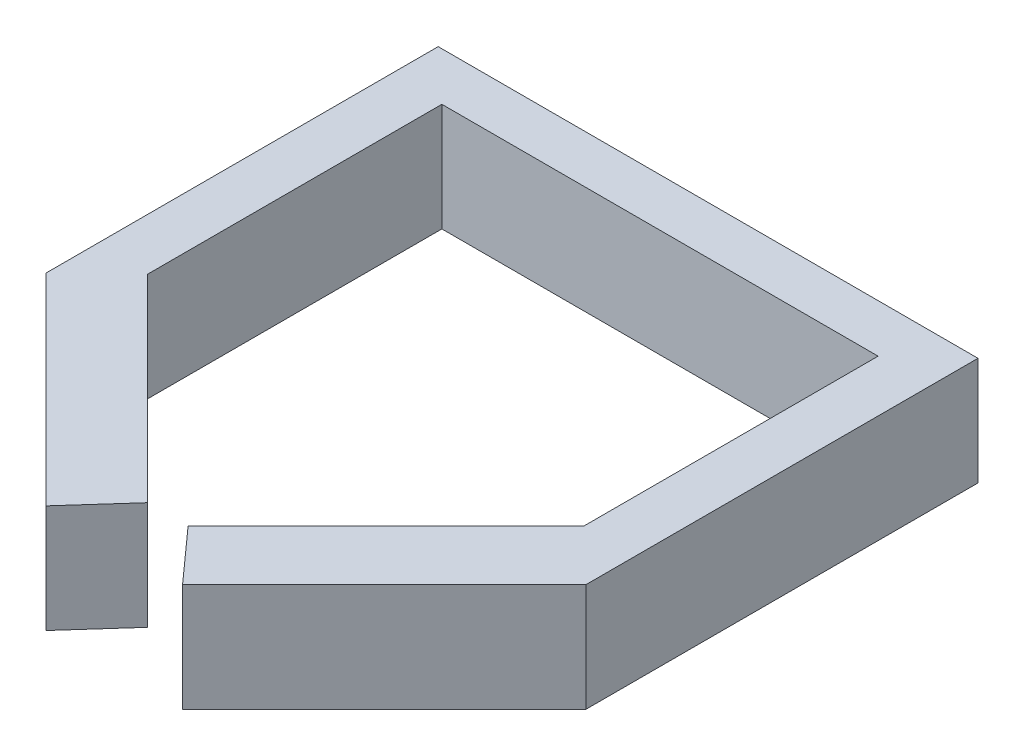
ISO-10303-21;
HEADER;
FILE_DESCRIPTION(('STEP AP214'),'2;1');
FILE_NAME('part.step','',(''),(''),'','','');
FILE_SCHEMA(('AUTOMOTIVE_DESIGN { 1 0 10303 214 1 1 1 1 }'));
ENDSEC;
DATA;
#1=APPLICATION_CONTEXT('core data for automotive mechanical design processes');
#2=APPLICATION_PROTOCOL_DEFINITION('international standard','automotive_design',2000,#1);
#3=PRODUCT_CONTEXT('',#1,'mechanical');
#4=PRODUCT('Part','Part','',(#3));
#5=PRODUCT_RELATED_PRODUCT_CATEGORY('part','',(#4));
#6=PRODUCT_DEFINITION_FORMATION('','',#4);
#7=PRODUCT_DEFINITION_CONTEXT('part definition',#1,'design');
#8=PRODUCT_DEFINITION('design','',#6,#7);
#9=PRODUCT_DEFINITION_SHAPE('','',#8);
#10=(LENGTH_UNIT() NAMED_UNIT(*) SI_UNIT(.MILLI.,.METRE.));
#11=(NAMED_UNIT(*) PLANE_ANGLE_UNIT() SI_UNIT($,.RADIAN.));
#12=(NAMED_UNIT(*) SI_UNIT($,.STERADIAN.) SOLID_ANGLE_UNIT());
#13=UNCERTAINTY_MEASURE_WITH_UNIT(LENGTH_MEASURE(1.E-05),#10,'distance_accuracy_value','');
#14=(GEOMETRIC_REPRESENTATION_CONTEXT(3) GLOBAL_UNCERTAINTY_ASSIGNED_CONTEXT((#13)) GLOBAL_UNIT_ASSIGNED_CONTEXT((#10,
#11,#12)) REPRESENTATION_CONTEXT('',''));
#15=CARTESIAN_POINT('',(0.,0.,0.));
#16=DIRECTION('',(0.,0.,1.));
#17=DIRECTION('',(1.,0.,0.));
#18=AXIS2_PLACEMENT_3D('',#15,#16,#17);
#19=CARTESIAN_POINT('',(50.,10.,-18.6760124610592));
#20=DIRECTION('',(-1.,0.,0.));
#21=DIRECTION('',(0.,0.,1.));
#22=AXIS2_PLACEMENT_3D('',#19,#20,#21);
#23=PLANE('',#22);
#24=DIRECTION('',(0.,0.,-1.));
#25=VECTOR('',#24,1.);
#26=CARTESIAN_POINT('',(50.,0.,-18.6760124610592));
#27=LINE('',#26,#25);
#28=CARTESIAN_POINT('',(50.,0.,-18.6760124610592));
#29=VERTEX_POINT('',#28);
#30=CARTESIAN_POINT('',(50.,0.,-55.));
#31=VERTEX_POINT('',#30);
#32=EDGE_CURVE('E156',#29,#31,#27,.T.);
#33=ORIENTED_EDGE('',*,*,#32,.T.);
#34=DIRECTION('',(0.,-1.,0.));
#35=VECTOR('',#34,1.);
#36=CARTESIAN_POINT('',(50.,10.,-55.));
#37=LINE('',#36,#35);
#38=CARTESIAN_POINT('',(50.,10.,-55.));
#39=VERTEX_POINT('',#38);
#40=EDGE_CURVE('E11',#39,#31,#37,.T.);
#41=ORIENTED_EDGE('',*,*,#40,.F.);
#42=DIRECTION('',(0.,0.,-1.));
#43=VECTOR('',#42,1.);
#44=CARTESIAN_POINT('',(50.,10.,-18.6760124610592));
#45=LINE('',#44,#43);
#46=CARTESIAN_POINT('',(50.,10.,-18.6760124610592));
#47=VERTEX_POINT('',#46);
#48=EDGE_CURVE('E178',#47,#39,#45,.T.);
#49=ORIENTED_EDGE('',*,*,#48,.F.);
#50=DIRECTION('',(0.,-1.,0.));
#51=VECTOR('',#50,1.);
#52=CARTESIAN_POINT('',(50.,10.,-18.6760124610592));
#53=LINE('',#52,#51);
#54=EDGE_CURVE('E152',#47,#29,#53,.T.);
#55=ORIENTED_EDGE('',*,*,#54,.T.);
#56=EDGE_LOOP('',(#33,#41,#49,#55));
#57=FACE_BOUND('',#56,.T.);
#58=ADVANCED_FACE('F36',(#57),#23,.F.);
#59=CARTESIAN_POINT('',(0.,10.,-55.));
#60=DIRECTION('',(0.,0.,1.));
#61=DIRECTION('',(1.,0.,0.));
#62=AXIS2_PLACEMENT_3D('',#59,#60,#61);
#63=PLANE('',#62);
#64=DIRECTION('',(-1.,0.,0.));
#65=VECTOR('',#64,1.);
#66=CARTESIAN_POINT('',(0.,0.,-55.));
#67=LINE('',#66,#65);
#68=CARTESIAN_POINT('',(0.,0.,-55.));
#69=VERTEX_POINT('',#68);
#70=EDGE_CURVE('E159',#31,#69,#67,.T.);
#71=ORIENTED_EDGE('',*,*,#70,.T.);
#72=DIRECTION('',(0.,-1.,0.));
#73=VECTOR('',#72,1.);
#74=CARTESIAN_POINT('',(0.,10.,-55.));
#75=LINE('',#74,#73);
#76=CARTESIAN_POINT('',(0.,10.,-55.));
#77=VERTEX_POINT('',#76);
#78=EDGE_CURVE('E44',#77,#69,#75,.T.);
#79=ORIENTED_EDGE('',*,*,#78,.F.);
#80=DIRECTION('',(-1.,0.,0.));
#81=VECTOR('',#80,1.);
#82=CARTESIAN_POINT('',(0.,10.,-55.));
#83=LINE('',#82,#81);
#84=EDGE_CURVE('E107',#39,#77,#83,.T.);
#85=ORIENTED_EDGE('',*,*,#84,.F.);
#86=ORIENTED_EDGE('',*,*,#40,.T.);
#87=EDGE_LOOP('',(#71,#79,#85,#86));
#88=FACE_BOUND('',#87,.T.);
#89=ADVANCED_FACE('F256',(#88),#63,.F.);
#90=CARTESIAN_POINT('',(0.,10.,-18.6760124610592));
#91=DIRECTION('',(1.,0.,0.));
#92=DIRECTION('',(0.,0.,-1.));
#93=AXIS2_PLACEMENT_3D('',#90,#91,#92);
#94=PLANE('',#93);
#95=DIRECTION('',(0.,0.,1.));
#96=VECTOR('',#95,1.);
#97=CARTESIAN_POINT('',(0.,0.,-18.6760124610592));
#98=LINE('',#97,#96);
#99=CARTESIAN_POINT('',(0.,0.,-18.6760124610592));
#100=VERTEX_POINT('',#99);
#101=EDGE_CURVE('E161',#69,#100,#98,.T.);
#102=ORIENTED_EDGE('',*,*,#101,.T.);
#103=DIRECTION('',(0.,-1.,0.));
#104=VECTOR('',#103,1.);
#105=CARTESIAN_POINT('',(0.,10.,-18.6760124610592));
#106=LINE('',#105,#104);
#107=CARTESIAN_POINT('',(0.,10.,-18.6760124610592));
#108=VERTEX_POINT('',#107);
#109=EDGE_CURVE('E197',#108,#100,#106,.T.);
#110=ORIENTED_EDGE('',*,*,#109,.F.);
#111=DIRECTION('',(0.,0.,1.));
#112=VECTOR('',#111,1.);
#113=CARTESIAN_POINT('',(0.,10.,-18.6760124610592));
#114=LINE('',#113,#112);
#115=EDGE_CURVE('E205',#77,#108,#114,.T.);
#116=ORIENTED_EDGE('',*,*,#115,.F.);
#117=ORIENTED_EDGE('',*,*,#78,.T.);
#118=EDGE_LOOP('',(#102,#110,#116,#117));
#119=FACE_BOUND('',#118,.T.);
#120=ADVANCED_FACE('F203',(#119),#94,.F.);
#121=CARTESIAN_POINT('',(0.,10.,-18.6760124610592));
#122=DIRECTION('',(0.707106781186539,0.,-0.707106781186556));
#123=DIRECTION('',(-0.707106781186556,0.,-0.707106781186539));
#124=AXIS2_PLACEMENT_3D('',#121,#122,#123);
#125=PLANE('',#124);
#126=DIRECTION('',(0.707106781186556,0.,0.707106781186539));
#127=VECTOR('',#126,1.);
#128=CARTESIAN_POINT('',(0.,0.,-18.6760124610592));
#129=LINE('',#128,#127);
#130=CARTESIAN_POINT('',(18.6760124610596,0.,0.));
#131=VERTEX_POINT('',#130);
#132=EDGE_CURVE('E163',#100,#131,#129,.T.);
#133=ORIENTED_EDGE('',*,*,#132,.T.);
#134=DIRECTION('',(0.,-1.,0.));
#135=VECTOR('',#134,1.);
#136=CARTESIAN_POINT('',(18.6760124610596,10.,0.));
#137=LINE('',#136,#135);
#138=CARTESIAN_POINT('',(18.6760124610596,10.,0.));
#139=VERTEX_POINT('',#138);
#140=EDGE_CURVE('E194',#139,#131,#137,.T.);
#141=ORIENTED_EDGE('',*,*,#140,.F.);
#142=DIRECTION('',(0.707106781186556,0.,0.707106781186539));
#143=VECTOR('',#142,1.);
#144=CARTESIAN_POINT('',(0.,10.,-18.6760124610592));
#145=LINE('',#144,#143);
#146=EDGE_CURVE('E223',#108,#139,#145,.T.);
#147=ORIENTED_EDGE('',*,*,#146,.F.);
#148=ORIENTED_EDGE('',*,*,#109,.T.);
#149=EDGE_LOOP('',(#133,#141,#147,#148));
#150=FACE_BOUND('',#149,.T.);
#151=ADVANCED_FACE('F214',(#150),#125,.F.);
#152=CARTESIAN_POINT('',(18.6760124610596,10.,0.));
#153=DIRECTION('',(-0.744569440646523,0.,-0.667545015751989));
#154=DIRECTION('',(-0.667545015751989,0.,0.744569440646523));
#155=AXIS2_PLACEMENT_3D('',#152,#153,#154);
#156=PLANE('',#155);
#157=DIRECTION('',(0.667545015751989,0.,-0.744569440646523));
#158=VECTOR('',#157,1.);
#159=CARTESIAN_POINT('',(18.6760124610596,0.,0.));
#160=LINE('',#159,#158);
#161=CARTESIAN_POINT('',(23.1308411214956,0.,-4.96884735202521));
#162=VERTEX_POINT('',#161);
#163=EDGE_CURVE('E165',#131,#162,#160,.T.);
#164=ORIENTED_EDGE('',*,*,#163,.T.);
#165=DIRECTION('',(0.,-1.,0.));
#166=VECTOR('',#165,1.);
#167=CARTESIAN_POINT('',(23.1308411214956,10.,-4.96884735202521));
#168=LINE('',#167,#166);
#169=CARTESIAN_POINT('',(23.1308411214956,10.,-4.96884735202521));
#170=VERTEX_POINT('',#169);
#171=EDGE_CURVE('E191',#170,#162,#168,.T.);
#172=ORIENTED_EDGE('',*,*,#171,.F.);
#173=DIRECTION('',(0.667545015751989,0.,-0.744569440646523));
#174=VECTOR('',#173,1.);
#175=CARTESIAN_POINT('',(18.6760124610596,10.,0.));
#176=LINE('',#175,#174);
#177=EDGE_CURVE('E220',#139,#170,#176,.T.);
#178=ORIENTED_EDGE('',*,*,#177,.F.);
#179=ORIENTED_EDGE('',*,*,#140,.T.);
#180=EDGE_LOOP('',(#164,#172,#178,#179));
#181=FACE_BOUND('',#180,.T.);
#182=ADVANCED_FACE('F218',(#181),#156,.F.);
#183=CARTESIAN_POINT('',(4.79750778816199,10.,-23.3021806853582));
#184=DIRECTION('',(-0.707106781186536,0.,0.707106781186559));
#185=DIRECTION('',(0.707106781186559,0.,0.707106781186536));
#186=AXIS2_PLACEMENT_3D('',#183,#184,#185);
#187=PLANE('',#186);
#188=DIRECTION('',(-0.707106781186559,0.,-0.707106781186536));
#189=VECTOR('',#188,1.);
#190=CARTESIAN_POINT('',(4.79750778816199,0.,-23.3021806853582));
#191=LINE('',#190,#189);
#192=CARTESIAN_POINT('',(4.79750778816199,0.,-23.3021806853582));
#193=VERTEX_POINT('',#192);
#194=EDGE_CURVE('E167',#162,#193,#191,.T.);
#195=ORIENTED_EDGE('',*,*,#194,.T.);
#196=DIRECTION('',(0.,-1.,0.));
#197=VECTOR('',#196,1.);
#198=CARTESIAN_POINT('',(4.79750778816199,10.,-23.3021806853582));
#199=LINE('',#198,#197);
#200=CARTESIAN_POINT('',(4.79750778816199,10.,-23.3021806853582));
#201=VERTEX_POINT('',#200);
#202=EDGE_CURVE('E188',#201,#193,#199,.T.);
#203=ORIENTED_EDGE('',*,*,#202,.F.);
#204=DIRECTION('',(-0.707106781186559,0.,-0.707106781186536));
#205=VECTOR('',#204,1.);
#206=CARTESIAN_POINT('',(4.79750778816199,10.,-23.3021806853582));
#207=LINE('',#206,#205);
#208=EDGE_CURVE('E222',#170,#201,#207,.T.);
#209=ORIENTED_EDGE('',*,*,#208,.F.);
#210=ORIENTED_EDGE('',*,*,#171,.T.);
#211=EDGE_LOOP('',(#195,#203,#209,#210));
#212=FACE_BOUND('',#211,.T.);
#213=ADVANCED_FACE('F269',(#212),#187,.F.);
#214=CARTESIAN_POINT('',(4.79750778816199,10.,-50.5451713395639));
#215=DIRECTION('',(-1.,0.,0.));
#216=DIRECTION('',(0.,0.,1.));
#217=AXIS2_PLACEMENT_3D('',#214,#215,#216);
#218=PLANE('',#217);
#219=DIRECTION('',(0.,0.,-1.));
#220=VECTOR('',#219,1.);
#221=CARTESIAN_POINT('',(4.79750778816199,0.,-50.5451713395639));
#222=LINE('',#221,#220);
#223=CARTESIAN_POINT('',(4.79750778816199,0.,-50.5451713395639));
#224=VERTEX_POINT('',#223);
#225=EDGE_CURVE('E169',#193,#224,#222,.T.);
#226=ORIENTED_EDGE('',*,*,#225,.T.);
#227=DIRECTION('',(0.,-1.,0.));
#228=VECTOR('',#227,1.);
#229=CARTESIAN_POINT('',(4.79750778816199,10.,-50.5451713395639));
#230=LINE('',#229,#228);
#231=CARTESIAN_POINT('',(4.79750778816199,10.,-50.5451713395639));
#232=VERTEX_POINT('',#231);
#233=EDGE_CURVE('E185',#232,#224,#230,.T.);
#234=ORIENTED_EDGE('',*,*,#233,.F.);
#235=DIRECTION('',(0.,0.,-1.));
#236=VECTOR('',#235,1.);
#237=CARTESIAN_POINT('',(4.79750778816199,10.,-50.5451713395639));
#238=LINE('',#237,#236);
#239=EDGE_CURVE('E225',#201,#232,#238,.T.);
#240=ORIENTED_EDGE('',*,*,#239,.F.);
#241=ORIENTED_EDGE('',*,*,#202,.T.);
#242=EDGE_LOOP('',(#226,#234,#240,#241));
#243=FACE_BOUND('',#242,.T.);
#244=ADVANCED_FACE('F272',(#243),#218,.F.);
#245=CARTESIAN_POINT('',(45.202492211838,10.,-50.5451713395639));
#246=DIRECTION('',(0.,0.,-1.));
#247=DIRECTION('',(-1.,0.,0.));
#248=AXIS2_PLACEMENT_3D('',#245,#246,#247);
#249=PLANE('',#248);
#250=DIRECTION('',(1.,0.,0.));
#251=VECTOR('',#250,1.);
#252=CARTESIAN_POINT('',(45.202492211838,0.,-50.5451713395639));
#253=LINE('',#252,#251);
#254=CARTESIAN_POINT('',(45.202492211838,0.,-50.5451713395639));
#255=VERTEX_POINT('',#254);
#256=EDGE_CURVE('E171',#224,#255,#253,.T.);
#257=ORIENTED_EDGE('',*,*,#256,.T.);
#258=DIRECTION('',(0.,-1.,0.));
#259=VECTOR('',#258,1.);
#260=CARTESIAN_POINT('',(45.202492211838,10.,-50.5451713395639));
#261=LINE('',#260,#259);
#262=CARTESIAN_POINT('',(45.202492211838,10.,-50.5451713395639));
#263=VERTEX_POINT('',#262);
#264=EDGE_CURVE('E182',#263,#255,#261,.T.);
#265=ORIENTED_EDGE('',*,*,#264,.F.);
#266=DIRECTION('',(1.,0.,0.));
#267=VECTOR('',#266,1.);
#268=CARTESIAN_POINT('',(45.202492211838,10.,-50.5451713395639));
#269=LINE('',#268,#267);
#270=EDGE_CURVE('E231',#232,#263,#269,.T.);
#271=ORIENTED_EDGE('',*,*,#270,.F.);
#272=ORIENTED_EDGE('',*,*,#233,.T.);
#273=EDGE_LOOP('',(#257,#265,#271,#272));
#274=FACE_BOUND('',#273,.T.);
#275=ADVANCED_FACE('F237',(#274),#249,.F.);
#276=CARTESIAN_POINT('',(45.202492211838,10.,-50.5451713395639));
#277=DIRECTION('',(1.,0.,0.));
#278=DIRECTION('',(0.,0.,-1.));
#279=AXIS2_PLACEMENT_3D('',#276,#277,#278);
#280=PLANE('',#279);
#281=DIRECTION('',(0.,0.,1.));
#282=VECTOR('',#281,1.);
#283=CARTESIAN_POINT('',(45.202492211838,0.,-50.5451713395639));
#284=LINE('',#283,#282);
#285=CARTESIAN_POINT('',(45.202492211838,0.,-23.3021806853582));
#286=VERTEX_POINT('',#285);
#287=EDGE_CURVE('E173',#255,#286,#284,.T.);
#288=ORIENTED_EDGE('',*,*,#287,.T.);
#289=DIRECTION('',(0.,-1.,0.));
#290=VECTOR('',#289,1.);
#291=CARTESIAN_POINT('',(45.202492211838,10.,-23.3021806853582));
#292=LINE('',#291,#290);
#293=CARTESIAN_POINT('',(45.202492211838,10.,-23.3021806853582));
#294=VERTEX_POINT('',#293);
#295=EDGE_CURVE('E147',#294,#286,#292,.T.);
#296=ORIENTED_EDGE('',*,*,#295,.F.);
#297=DIRECTION('',(0.,0.,1.));
#298=VECTOR('',#297,1.);
#299=CARTESIAN_POINT('',(45.202492211838,10.,-50.5451713395639));
#300=LINE('',#299,#298);
#301=EDGE_CURVE('E138',#263,#294,#300,.T.);
#302=ORIENTED_EDGE('',*,*,#301,.F.);
#303=ORIENTED_EDGE('',*,*,#264,.T.);
#304=EDGE_LOOP('',(#288,#296,#302,#303));
#305=FACE_BOUND('',#304,.T.);
#306=ADVANCED_FACE('F241',(#305),#280,.F.);
#307=CARTESIAN_POINT('',(45.202492211838,10.,-23.3021806853582));
#308=DIRECTION('',(0.707106781186536,0.,0.707106781186559));
#309=DIRECTION('',(0.707106781186559,0.,-0.707106781186536));
#310=AXIS2_PLACEMENT_3D('',#307,#308,#309);
#311=PLANE('',#310);
#312=DIRECTION('',(-0.707106781186559,0.,0.707106781186536));
#313=VECTOR('',#312,1.);
#314=CARTESIAN_POINT('',(45.202492211838,0.,-23.3021806853582));
#315=LINE('',#314,#313);
#316=CARTESIAN_POINT('',(26.8691588785044,0.,-4.96884735202521));
#317=VERTEX_POINT('',#316);
#318=EDGE_CURVE('E146',#286,#317,#315,.T.);
#319=ORIENTED_EDGE('',*,*,#318,.T.);
#320=DIRECTION('',(0.,-1.,0.));
#321=VECTOR('',#320,1.);
#322=CARTESIAN_POINT('',(26.8691588785044,10.,-4.96884735202521));
#323=LINE('',#322,#321);
#324=CARTESIAN_POINT('',(26.8691588785044,10.,-4.96884735202521));
#325=VERTEX_POINT('',#324);
#326=EDGE_CURVE('E143',#325,#317,#323,.T.);
#327=ORIENTED_EDGE('',*,*,#326,.F.);
#328=DIRECTION('',(-0.707106781186559,0.,0.707106781186536));
#329=VECTOR('',#328,1.);
#330=CARTESIAN_POINT('',(45.202492211838,10.,-23.3021806853582));
#331=LINE('',#330,#329);
#332=EDGE_CURVE('E132',#294,#325,#331,.T.);
#333=ORIENTED_EDGE('',*,*,#332,.F.);
#334=ORIENTED_EDGE('',*,*,#295,.T.);
#335=EDGE_LOOP('',(#319,#327,#333,#334));
#336=FACE_BOUND('',#335,.T.);
#337=ADVANCED_FACE('F144',(#336),#311,.F.);
#338=CARTESIAN_POINT('',(31.3239875389404,10.,0.));
#339=DIRECTION('',(0.744569440646523,0.,-0.667545015751989));
#340=DIRECTION('',(-0.667545015751989,0.,-0.744569440646523));
#341=AXIS2_PLACEMENT_3D('',#338,#339,#340);
#342=PLANE('',#341);
#343=DIRECTION('',(0.667545015751989,0.,0.744569440646523));
#344=VECTOR('',#343,1.);
#345=CARTESIAN_POINT('',(31.3239875389404,0.,0.));
#346=LINE('',#345,#344);
#347=CARTESIAN_POINT('',(31.3239875389404,0.,0.));
#348=VERTEX_POINT('',#347);
#349=EDGE_CURVE('E93',#317,#348,#346,.T.);
#350=ORIENTED_EDGE('',*,*,#349,.T.);
#351=DIRECTION('',(0.,-1.,0.));
#352=VECTOR('',#351,1.);
#353=CARTESIAN_POINT('',(31.3239875389404,10.,0.));
#354=LINE('',#353,#352);
#355=CARTESIAN_POINT('',(31.3239875389404,10.,0.));
#356=VERTEX_POINT('',#355);
#357=EDGE_CURVE('E148',#356,#348,#354,.T.);
#358=ORIENTED_EDGE('',*,*,#357,.F.);
#359=DIRECTION('',(0.667545015751989,0.,0.744569440646523));
#360=VECTOR('',#359,1.);
#361=CARTESIAN_POINT('',(31.3239875389404,10.,0.));
#362=LINE('',#361,#360);
#363=EDGE_CURVE('E136',#325,#356,#362,.T.);
#364=ORIENTED_EDGE('',*,*,#363,.F.);
#365=ORIENTED_EDGE('',*,*,#326,.T.);
#366=EDGE_LOOP('',(#350,#358,#364,#365));
#367=FACE_BOUND('',#366,.T.);
#368=ADVANCED_FACE('F150',(#367),#342,.F.);
#369=CARTESIAN_POINT('',(50.,10.,-18.6760124610592));
#370=DIRECTION('',(-0.707106781186539,0.,-0.707106781186556));
#371=DIRECTION('',(-0.707106781186556,0.,0.707106781186539));
#372=AXIS2_PLACEMENT_3D('',#369,#370,#371);
#373=PLANE('',#372);
#374=DIRECTION('',(0.707106781186556,0.,-0.707106781186539));
#375=VECTOR('',#374,1.);
#376=CARTESIAN_POINT('',(50.,0.,-18.6760124610592));
#377=LINE('',#376,#375);
#378=EDGE_CURVE('E99',#348,#29,#377,.T.);
#379=ORIENTED_EDGE('',*,*,#378,.T.);
#380=ORIENTED_EDGE('',*,*,#54,.F.);
#381=DIRECTION('',(0.707106781186556,0.,-0.707106781186539));
#382=VECTOR('',#381,1.);
#383=CARTESIAN_POINT('',(50.,10.,-18.6760124610592));
#384=LINE('',#383,#382);
#385=EDGE_CURVE('E52',#356,#47,#384,.T.);
#386=ORIENTED_EDGE('',*,*,#385,.F.);
#387=ORIENTED_EDGE('',*,*,#357,.T.);
#388=EDGE_LOOP('',(#379,#380,#386,#387));
#389=FACE_BOUND('',#388,.T.);
#390=ADVANCED_FACE('F245',(#389),#373,.F.);
#391=CARTESIAN_POINT('',(0.,10.,0.));
#392=DIRECTION('',(0.,-1.,0.));
#393=DIRECTION('',(0.,0.,-1.));
#394=AXIS2_PLACEMENT_3D('',#391,#392,#393);
#395=PLANE('',#394);
#396=ORIENTED_EDGE('',*,*,#48,.T.);
#397=ORIENTED_EDGE('',*,*,#84,.T.);
#398=ORIENTED_EDGE('',*,*,#115,.T.);
#399=ORIENTED_EDGE('',*,*,#146,.T.);
#400=ORIENTED_EDGE('',*,*,#177,.T.);
#401=ORIENTED_EDGE('',*,*,#208,.T.);
#402=ORIENTED_EDGE('',*,*,#239,.T.);
#403=ORIENTED_EDGE('',*,*,#270,.T.);
#404=ORIENTED_EDGE('',*,*,#301,.T.);
#405=ORIENTED_EDGE('',*,*,#332,.T.);
#406=ORIENTED_EDGE('',*,*,#363,.T.);
#407=ORIENTED_EDGE('',*,*,#385,.T.);
#408=EDGE_LOOP('',(#396,#397,#398,#399,#400,#401,#402,#403,#404,#405,#406,#407));
#409=FACE_BOUND('',#408,.T.);
#410=ADVANCED_FACE('F134',(#409),#395,.F.);
#411=CARTESIAN_POINT('',(0.,0.,0.));
#412=DIRECTION('',(0.,-1.,0.));
#413=DIRECTION('',(0.,0.,-1.));
#414=AXIS2_PLACEMENT_3D('',#411,#412,#413);
#415=PLANE('',#414);
#416=ORIENTED_EDGE('',*,*,#32,.F.);
#417=ORIENTED_EDGE('',*,*,#378,.F.);
#418=ORIENTED_EDGE('',*,*,#349,.F.);
#419=ORIENTED_EDGE('',*,*,#318,.F.);
#420=ORIENTED_EDGE('',*,*,#287,.F.);
#421=ORIENTED_EDGE('',*,*,#256,.F.);
#422=ORIENTED_EDGE('',*,*,#225,.F.);
#423=ORIENTED_EDGE('',*,*,#194,.F.);
#424=ORIENTED_EDGE('',*,*,#163,.F.);
#425=ORIENTED_EDGE('',*,*,#132,.F.);
#426=ORIENTED_EDGE('',*,*,#101,.F.);
#427=ORIENTED_EDGE('',*,*,#70,.F.);
#428=EDGE_LOOP('',(#416,#417,#418,#419,#420,#421,#422,#423,#424,#425,#426,#427));
#429=FACE_BOUND('',#428,.T.);
#430=ADVANCED_FACE('F209',(#429),#415,.T.);
#431=CLOSED_SHELL('',(#58,#89,#120,#151,#182,#213,#244,#275,#306,#337,#368,#390,#410,#430));
#432=MANIFOLD_SOLID_BREP('B2',#431);
#433=ADVANCED_BREP_SHAPE_REPRESENTATION('',(#18,#432),#14);
#434=SHAPE_DEFINITION_REPRESENTATION(#9,#433);
ENDSEC;
END-ISO-10303-21;
